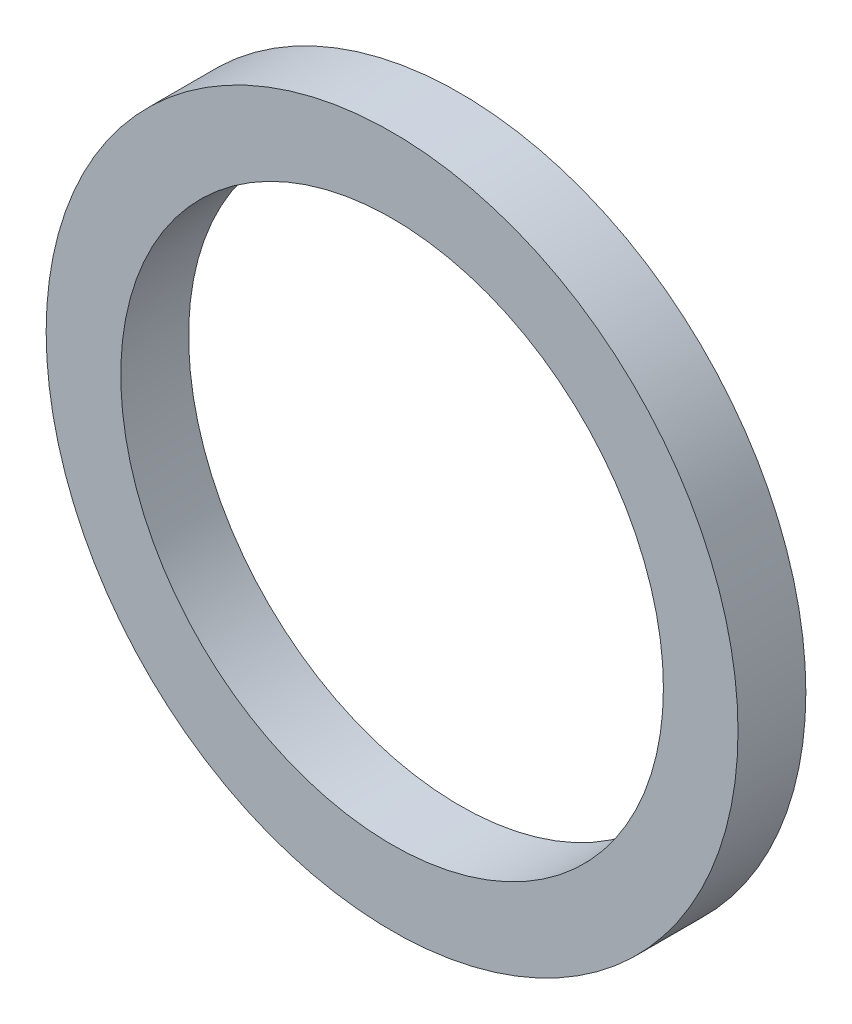
ISO-10303-21;
HEADER;
FILE_DESCRIPTION(('STEP AP214'),'2;1');
FILE_NAME('part.step','',(''),(''),'','','');
FILE_SCHEMA(('AUTOMOTIVE_DESIGN { 1 0 10303 214 1 1 1 1 }'));
ENDSEC;
DATA;
#1=APPLICATION_CONTEXT('core data for automotive mechanical design processes');
#2=APPLICATION_PROTOCOL_DEFINITION('international standard','automotive_design',2000,#1);
#3=PRODUCT_CONTEXT('',#1,'mechanical');
#4=PRODUCT('Part','Part','',(#3));
#5=PRODUCT_RELATED_PRODUCT_CATEGORY('part','',(#4));
#6=PRODUCT_DEFINITION_FORMATION('','',#4);
#7=PRODUCT_DEFINITION_CONTEXT('part definition',#1,'design');
#8=PRODUCT_DEFINITION('design','',#6,#7);
#9=PRODUCT_DEFINITION_SHAPE('','',#8);
#10=(LENGTH_UNIT() NAMED_UNIT(*) SI_UNIT(.MILLI.,.METRE.));
#11=(NAMED_UNIT(*) PLANE_ANGLE_UNIT() SI_UNIT($,.RADIAN.));
#12=(NAMED_UNIT(*) SI_UNIT($,.STERADIAN.) SOLID_ANGLE_UNIT());
#13=UNCERTAINTY_MEASURE_WITH_UNIT(LENGTH_MEASURE(1.E-05),#10,'distance_accuracy_value','');
#14=(GEOMETRIC_REPRESENTATION_CONTEXT(3) GLOBAL_UNCERTAINTY_ASSIGNED_CONTEXT((#13)) GLOBAL_UNIT_ASSIGNED_CONTEXT((#10,
#11,#12)) REPRESENTATION_CONTEXT('',''));
#15=CARTESIAN_POINT('',(0.,0.,0.));
#16=DIRECTION('',(0.,0.,1.));
#17=DIRECTION('',(1.,0.,0.));
#18=AXIS2_PLACEMENT_3D('',#15,#16,#17);
#19=CARTESIAN_POINT('',(0.,0.,6.));
#20=DIRECTION('',(0.,0.,-1.));
#21=DIRECTION('',(-1.,0.,0.));
#22=AXIS2_PLACEMENT_3D('',#19,#20,#21);
#23=CYLINDRICAL_SURFACE('',#22,25.5);
#24=CARTESIAN_POINT('',(0.,0.,5.));
#25=DIRECTION('',(0.,0.,1.));
#26=DIRECTION('',(1.,0.,0.));
#27=AXIS2_PLACEMENT_3D('',#24,#25,#26);
#28=CIRCLE('',#27,25.5);
#29=CARTESIAN_POINT('',(25.5,0.,5.));
#30=VERTEX_POINT('',#29);
#31=EDGE_CURVE('E22',#30,#30,#28,.T.);
#32=ORIENTED_EDGE('',*,*,#31,.F.);
#33=EDGE_LOOP('',(#32));
#34=FACE_BOUND('',#33,.T.);
#35=CARTESIAN_POINT('',(0.,0.,0.));
#36=DIRECTION('',(0.,0.,1.));
#37=DIRECTION('',(1.,0.,0.));
#38=AXIS2_PLACEMENT_3D('',#35,#36,#37);
#39=CIRCLE('',#38,25.5);
#40=CARTESIAN_POINT('',(25.5,0.,0.));
#41=VERTEX_POINT('',#40);
#42=EDGE_CURVE('E30',#41,#41,#39,.T.);
#43=ORIENTED_EDGE('',*,*,#42,.T.);
#44=EDGE_LOOP('',(#43));
#45=FACE_BOUND('',#44,.T.);
#46=ADVANCED_FACE('F15',(#34,#45),#23,.T.);
#47=CARTESIAN_POINT('',(0.,0.,6.));
#48=DIRECTION('',(0.,0.,-1.));
#49=DIRECTION('',(-1.,0.,0.));
#50=AXIS2_PLACEMENT_3D('',#47,#48,#49);
#51=CYLINDRICAL_SURFACE('',#50,20.);
#52=CARTESIAN_POINT('',(0.,0.,5.));
#53=DIRECTION('',(0.,0.,1.));
#54=DIRECTION('',(1.,0.,0.));
#55=AXIS2_PLACEMENT_3D('',#52,#53,#54);
#56=CIRCLE('',#55,20.);
#57=CARTESIAN_POINT('',(20.,0.,5.));
#58=VERTEX_POINT('',#57);
#59=EDGE_CURVE('E10',#58,#58,#56,.T.);
#60=ORIENTED_EDGE('',*,*,#59,.T.);
#61=EDGE_LOOP('',(#60));
#62=FACE_BOUND('',#61,.T.);
#63=CARTESIAN_POINT('',(0.,0.,0.));
#64=DIRECTION('',(0.,0.,1.));
#65=DIRECTION('',(1.,0.,0.));
#66=AXIS2_PLACEMENT_3D('',#63,#64,#65);
#67=CIRCLE('',#66,20.);
#68=CARTESIAN_POINT('',(20.,0.,0.));
#69=VERTEX_POINT('',#68);
#70=EDGE_CURVE('E26',#69,#69,#67,.T.);
#71=ORIENTED_EDGE('',*,*,#70,.F.);
#72=EDGE_LOOP('',(#71));
#73=FACE_BOUND('',#72,.T.);
#74=ADVANCED_FACE('F43',(#62,#73),#51,.F.);
#75=CARTESIAN_POINT('',(0.,0.,5.));
#76=DIRECTION('',(0.,0.,1.));
#77=DIRECTION('',(1.,0.,0.));
#78=AXIS2_PLACEMENT_3D('',#75,#76,#77);
#79=PLANE('',#78);
#80=ORIENTED_EDGE('',*,*,#31,.T.);
#81=EDGE_LOOP('',(#80));
#82=FACE_BOUND('',#81,.T.);
#83=ORIENTED_EDGE('',*,*,#59,.F.);
#84=EDGE_LOOP('',(#83));
#85=FACE_BOUND('',#84,.T.);
#86=ADVANCED_FACE('F17',(#82,#85),#79,.T.);
#87=CARTESIAN_POINT('',(0.,0.,0.));
#88=DIRECTION('',(0.,0.,1.));
#89=DIRECTION('',(1.,0.,0.));
#90=AXIS2_PLACEMENT_3D('',#87,#88,#89);
#91=PLANE('',#90);
#92=ORIENTED_EDGE('',*,*,#42,.F.);
#93=EDGE_LOOP('',(#92));
#94=FACE_BOUND('',#93,.T.);
#95=ORIENTED_EDGE('',*,*,#70,.T.);
#96=EDGE_LOOP('',(#95));
#97=FACE_BOUND('',#96,.T.);
#98=ADVANCED_FACE('F37',(#94,#97),#91,.F.);
#99=CLOSED_SHELL('',(#46,#74,#86,#98));
#100=MANIFOLD_SOLID_BREP('B1',#99);
#101=ADVANCED_BREP_SHAPE_REPRESENTATION('',(#18,#100),#14);
#102=SHAPE_DEFINITION_REPRESENTATION(#9,#101);
ENDSEC;
END-ISO-10303-21;
